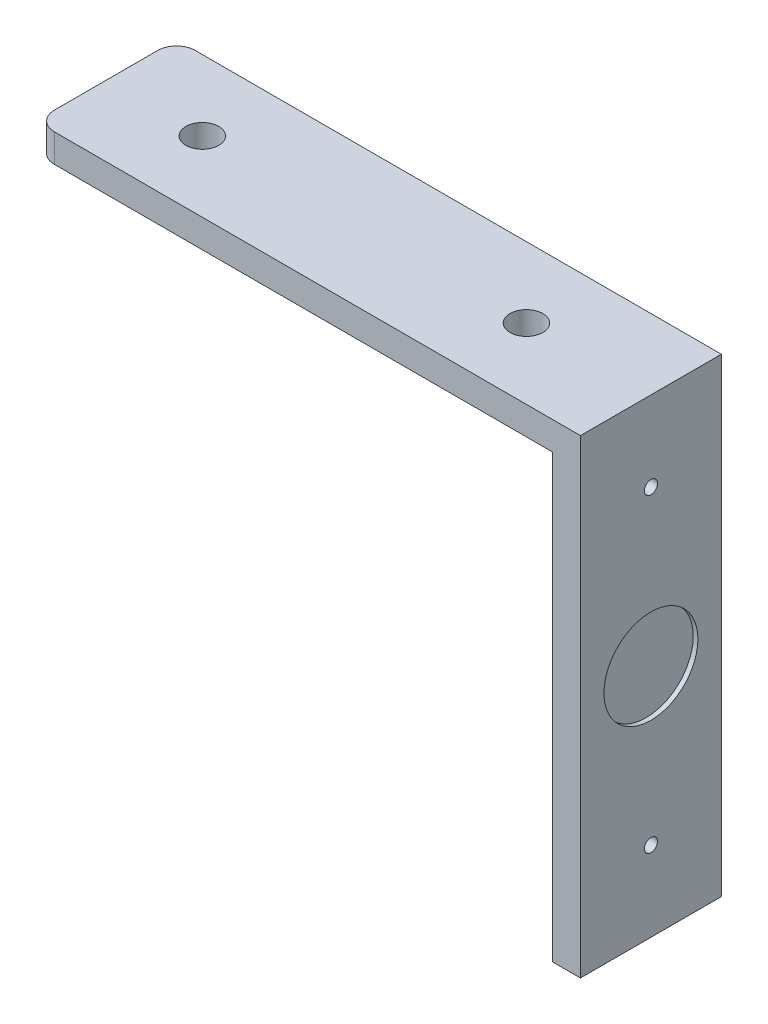
ISO-10303-21;
HEADER;
FILE_DESCRIPTION(('STEP AP214'),'2;1');
FILE_NAME('part.step','',(''),(''),'','','');
FILE_SCHEMA(('AUTOMOTIVE_DESIGN { 1 0 10303 214 1 1 1 1 }'));
ENDSEC;
DATA;
#1=APPLICATION_CONTEXT('core data for automotive mechanical design processes');
#2=APPLICATION_PROTOCOL_DEFINITION('international standard','automotive_design',2000,#1);
#3=PRODUCT_CONTEXT('',#1,'mechanical');
#4=PRODUCT('Part','Part','',(#3));
#5=PRODUCT_RELATED_PRODUCT_CATEGORY('part','',(#4));
#6=PRODUCT_DEFINITION_FORMATION('','',#4);
#7=PRODUCT_DEFINITION_CONTEXT('part definition',#1,'design');
#8=PRODUCT_DEFINITION('design','',#6,#7);
#9=PRODUCT_DEFINITION_SHAPE('','',#8);
#10=(LENGTH_UNIT() NAMED_UNIT(*) SI_UNIT(.MILLI.,.METRE.));
#11=(NAMED_UNIT(*) PLANE_ANGLE_UNIT() SI_UNIT($,.RADIAN.));
#12=(NAMED_UNIT(*) SI_UNIT($,.STERADIAN.) SOLID_ANGLE_UNIT());
#13=UNCERTAINTY_MEASURE_WITH_UNIT(LENGTH_MEASURE(1.E-05),#10,'distance_accuracy_value','');
#14=(GEOMETRIC_REPRESENTATION_CONTEXT(3) GLOBAL_UNCERTAINTY_ASSIGNED_CONTEXT((#13)) GLOBAL_UNIT_ASSIGNED_CONTEXT((#10,
#11,#12)) REPRESENTATION_CONTEXT('',''));
#15=CARTESIAN_POINT('',(0.,0.,0.));
#16=DIRECTION('',(0.,0.,1.));
#17=DIRECTION('',(1.,0.,0.));
#18=AXIS2_PLACEMENT_3D('',#15,#16,#17);
#19=CARTESIAN_POINT('',(-11.7258058761761,3.,18.6727949881747));
#20=DIRECTION('',(0.,1.,0.));
#21=DIRECTION('',(0.,0.,1.));
#22=AXIS2_PLACEMENT_3D('',#19,#20,#21);
#23=CYLINDRICAL_SURFACE('',#22,2.);
#24=DIRECTION('',(0.,1.,0.));
#25=VECTOR('',#24,1.);
#26=CARTESIAN_POINT('',(-13.7258058761761,3.,18.6727949881747));
#27=LINE('',#26,#25);
#28=CARTESIAN_POINT('',(-13.7258058761761,0.,18.6727949881747));
#29=VERTEX_POINT('',#28);
#30=CARTESIAN_POINT('',(-13.7258058761761,3.,18.6727949881747));
#31=VERTEX_POINT('',#30);
#32=EDGE_CURVE('E175',#29,#31,#27,.T.);
#33=ORIENTED_EDGE('',*,*,#32,.F.);
#34=CARTESIAN_POINT('',(-11.7258058761761,0.,18.6727949881747));
#35=DIRECTION('',(0.,1.,0.));
#36=DIRECTION('',(0.,0.,1.));
#37=AXIS2_PLACEMENT_3D('',#34,#35,#36);
#38=CIRCLE('',#37,2.);
#39=CARTESIAN_POINT('',(-11.7258058761761,0.,20.6727949881747));
#40=VERTEX_POINT('',#39);
#41=EDGE_CURVE('E40',#40,#29,#38,.F.);
#42=ORIENTED_EDGE('',*,*,#41,.F.);
#43=DIRECTION('',(0.,1.,0.));
#44=VECTOR('',#43,1.);
#45=CARTESIAN_POINT('',(-11.7258058761761,3.,20.6727949881747));
#46=LINE('',#45,#44);
#47=CARTESIAN_POINT('',(-11.7258058761761,3.,20.6727949881747));
#48=VERTEX_POINT('',#47);
#49=EDGE_CURVE('E178',#48,#40,#46,.F.);
#50=ORIENTED_EDGE('',*,*,#49,.F.);
#51=CARTESIAN_POINT('',(-11.7258058761761,3.,18.6727949881747));
#52=DIRECTION('',(0.,1.,0.));
#53=DIRECTION('',(0.,0.,1.));
#54=AXIS2_PLACEMENT_3D('',#51,#52,#53);
#55=CIRCLE('',#54,2.);
#56=EDGE_CURVE('E11',#31,#48,#55,.T.);
#57=ORIENTED_EDGE('',*,*,#56,.F.);
#58=EDGE_LOOP('',(#33,#42,#50,#57));
#59=FACE_BOUND('',#58,.T.);
#60=ADVANCED_FACE('F33',(#59),#23,.T.);
#61=CARTESIAN_POINT('',(-11.7258058761761,3.,7.6727949881747));
#62=DIRECTION('',(0.,-1.,0.));
#63=DIRECTION('',(0.,0.,-1.));
#64=AXIS2_PLACEMENT_3D('',#61,#62,#63);
#65=CYLINDRICAL_SURFACE('',#64,2.);
#66=DIRECTION('',(0.,-1.,0.));
#67=VECTOR('',#66,1.);
#68=CARTESIAN_POINT('',(-13.7258058761761,3.,7.6727949881747));
#69=LINE('',#68,#67);
#70=CARTESIAN_POINT('',(-13.7258058761761,3.,7.67279498817471));
#71=VERTEX_POINT('',#70);
#72=CARTESIAN_POINT('',(-13.7258058761761,0.,7.67279498817471));
#73=VERTEX_POINT('',#72);
#74=EDGE_CURVE('E158',#71,#73,#69,.T.);
#75=ORIENTED_EDGE('',*,*,#74,.F.);
#76=CARTESIAN_POINT('',(-11.7258058761761,3.,7.6727949881747));
#77=DIRECTION('',(0.,1.,0.));
#78=DIRECTION('',(0.,0.,1.));
#79=AXIS2_PLACEMENT_3D('',#76,#77,#78);
#80=CIRCLE('',#79,2.);
#81=CARTESIAN_POINT('',(-11.7258058761761,3.,5.6727949881747));
#82=VERTEX_POINT('',#81);
#83=EDGE_CURVE('E171',#82,#71,#80,.T.);
#84=ORIENTED_EDGE('',*,*,#83,.F.);
#85=DIRECTION('',(0.,-1.,0.));
#86=VECTOR('',#85,1.);
#87=CARTESIAN_POINT('',(-11.7258058761761,3.,5.6727949881747));
#88=LINE('',#87,#86);
#89=CARTESIAN_POINT('',(-11.7258058761761,0.,5.6727949881747));
#90=VERTEX_POINT('',#89);
#91=EDGE_CURVE('E168',#90,#82,#88,.F.);
#92=ORIENTED_EDGE('',*,*,#91,.F.);
#93=CARTESIAN_POINT('',(-11.7258058761761,0.,7.6727949881747));
#94=DIRECTION('',(0.,1.,0.));
#95=DIRECTION('',(0.,0.,1.));
#96=AXIS2_PLACEMENT_3D('',#93,#94,#95);
#97=CIRCLE('',#96,2.);
#98=EDGE_CURVE('E173',#73,#90,#97,.F.);
#99=ORIENTED_EDGE('',*,*,#98,.F.);
#100=EDGE_LOOP('',(#75,#84,#92,#99));
#101=FACE_BOUND('',#100,.T.);
#102=ADVANCED_FACE('F187',(#101),#65,.T.);
#103=CARTESIAN_POINT('',(-13.7258058761761,3.,5.6727949881747));
#104=DIRECTION('',(1.,0.,0.));
#105=DIRECTION('',(0.,0.,-1.));
#106=AXIS2_PLACEMENT_3D('',#103,#104,#105);
#107=PLANE('',#106);
#108=DIRECTION('',(0.,0.,1.));
#109=VECTOR('',#108,1.);
#110=CARTESIAN_POINT('',(-13.7258058761761,0.,5.6727949881747));
#111=LINE('',#110,#109);
#112=EDGE_CURVE('E147',#73,#29,#111,.T.);
#113=ORIENTED_EDGE('',*,*,#112,.T.);
#114=ORIENTED_EDGE('',*,*,#32,.T.);
#115=DIRECTION('',(0.,0.,1.));
#116=VECTOR('',#115,1.);
#117=CARTESIAN_POINT('',(-13.7258058761761,3.,5.6727949881747));
#118=LINE('',#117,#116);
#119=EDGE_CURVE('E150',#71,#31,#118,.T.);
#120=ORIENTED_EDGE('',*,*,#119,.F.);
#121=ORIENTED_EDGE('',*,*,#74,.T.);
#122=EDGE_LOOP('',(#113,#114,#120,#121));
#123=FACE_BOUND('',#122,.T.);
#124=ADVANCED_FACE('F184',(#123),#107,.F.);
#125=CARTESIAN_POINT('',(-13.7258058761761,3.,20.6727949881747));
#126=DIRECTION('',(0.,0.,-1.));
#127=DIRECTION('',(-1.,0.,0.));
#128=AXIS2_PLACEMENT_3D('',#125,#126,#127);
#129=PLANE('',#128);
#130=DIRECTION('',(1.,0.,0.));
#131=VECTOR('',#130,1.);
#132=CARTESIAN_POINT('',(-13.7258058761761,3.,20.6727949881747));
#133=LINE('',#132,#131);
#134=CARTESIAN_POINT('',(44.2741941238239,3.,20.6727949881747));
#135=VERTEX_POINT('',#134);
#136=EDGE_CURVE('E152',#48,#135,#133,.T.);
#137=ORIENTED_EDGE('',*,*,#136,.F.);
#138=ORIENTED_EDGE('',*,*,#49,.T.);
#139=DIRECTION('',(1.,0.,0.));
#140=VECTOR('',#139,1.);
#141=CARTESIAN_POINT('',(-13.7258058761761,0.,20.6727949881747));
#142=LINE('',#141,#140);
#143=CARTESIAN_POINT('',(41.2741941238239,0.,20.6727949881747));
#144=VERTEX_POINT('',#143);
#145=EDGE_CURVE('E101',#40,#144,#142,.T.);
#146=ORIENTED_EDGE('',*,*,#145,.T.);
#147=DIRECTION('',(0.,1.,0.));
#148=VECTOR('',#147,1.);
#149=CARTESIAN_POINT('',(41.2741941238239,-47.,20.6727949881747));
#150=LINE('',#149,#148);
#151=CARTESIAN_POINT('',(41.2741941238239,-47.,20.6727949881747));
#152=VERTEX_POINT('',#151);
#153=EDGE_CURVE('E94',#152,#144,#150,.T.);
#154=ORIENTED_EDGE('',*,*,#153,.F.);
#155=DIRECTION('',(1.,0.,0.));
#156=VECTOR('',#155,1.);
#157=CARTESIAN_POINT('',(41.2741941238239,-47.,20.6727949881747));
#158=LINE('',#157,#156);
#159=CARTESIAN_POINT('',(44.2741941238239,-47.,20.6727949881747));
#160=VERTEX_POINT('',#159);
#161=EDGE_CURVE('E99',#152,#160,#158,.T.);
#162=ORIENTED_EDGE('',*,*,#161,.T.);
#163=DIRECTION('',(0.,1.,0.));
#164=VECTOR('',#163,1.);
#165=CARTESIAN_POINT('',(44.2741941238239,-47.,20.6727949881747));
#166=LINE('',#165,#164);
#167=EDGE_CURVE('E106',#160,#135,#166,.T.);
#168=ORIENTED_EDGE('',*,*,#167,.T.);
#169=EDGE_LOOP('',(#137,#138,#146,#154,#162,#168));
#170=FACE_BOUND('',#169,.T.);
#171=ADVANCED_FACE('F97',(#170),#129,.F.);
#172=CARTESIAN_POINT('',(-13.7258058761761,3.,5.6727949881747));
#173=DIRECTION('',(0.,0.,1.));
#174=DIRECTION('',(1.,0.,0.));
#175=AXIS2_PLACEMENT_3D('',#172,#173,#174);
#176=PLANE('',#175);
#177=DIRECTION('',(-1.,0.,0.));
#178=VECTOR('',#177,1.);
#179=CARTESIAN_POINT('',(-13.7258058761761,0.,5.6727949881747));
#180=LINE('',#179,#178);
#181=CARTESIAN_POINT('',(41.2741941238239,0.,5.6727949881747));
#182=VERTEX_POINT('',#181);
#183=EDGE_CURVE('E153',#182,#90,#180,.T.);
#184=ORIENTED_EDGE('',*,*,#183,.T.);
#185=ORIENTED_EDGE('',*,*,#91,.T.);
#186=DIRECTION('',(-1.,0.,0.));
#187=VECTOR('',#186,1.);
#188=CARTESIAN_POINT('',(-13.7258058761761,3.,5.6727949881747));
#189=LINE('',#188,#187);
#190=CARTESIAN_POINT('',(44.2741941238239,3.,5.6727949881747));
#191=VERTEX_POINT('',#190);
#192=EDGE_CURVE('E155',#191,#82,#189,.T.);
#193=ORIENTED_EDGE('',*,*,#192,.F.);
#194=DIRECTION('',(0.,1.,0.));
#195=VECTOR('',#194,1.);
#196=CARTESIAN_POINT('',(44.2741941238239,-47.,5.6727949881747));
#197=LINE('',#196,#195);
#198=CARTESIAN_POINT('',(44.2741941238239,-47.,5.6727949881747));
#199=VERTEX_POINT('',#198);
#200=EDGE_CURVE('E134',#199,#191,#197,.T.);
#201=ORIENTED_EDGE('',*,*,#200,.F.);
#202=DIRECTION('',(-1.,0.,0.));
#203=VECTOR('',#202,1.);
#204=CARTESIAN_POINT('',(41.2741941238239,-47.,5.6727949881747));
#205=LINE('',#204,#203);
#206=CARTESIAN_POINT('',(41.2741941238239,-47.,5.6727949881747));
#207=VERTEX_POINT('',#206);
#208=EDGE_CURVE('E107',#199,#207,#205,.T.);
#209=ORIENTED_EDGE('',*,*,#208,.T.);
#210=DIRECTION('',(0.,1.,0.));
#211=VECTOR('',#210,1.);
#212=CARTESIAN_POINT('',(41.2741941238239,-47.,5.6727949881747));
#213=LINE('',#212,#211);
#214=EDGE_CURVE('E121',#207,#182,#213,.T.);
#215=ORIENTED_EDGE('',*,*,#214,.T.);
#216=EDGE_LOOP('',(#184,#185,#193,#201,#209,#215));
#217=FACE_BOUND('',#216,.T.);
#218=ADVANCED_FACE('F190',(#217),#176,.F.);
#219=CARTESIAN_POINT('',(0.,3.,0.));
#220=DIRECTION('',(0.,1.,0.));
#221=DIRECTION('',(0.,0.,1.));
#222=AXIS2_PLACEMENT_3D('',#219,#220,#221);
#223=PLANE('',#222);
#224=CARTESIAN_POINT('',(31.0241941238239,3.,13.1727949881747));
#225=DIRECTION('',(0.,-1.,0.));
#226=DIRECTION('',(0.,0.,1.));
#227=AXIS2_PLACEMENT_3D('',#224,#225,#226);
#228=CIRCLE('',#227,1.75);
#229=CARTESIAN_POINT('',(31.0241941238239,3.,14.9227949881747));
#230=VERTEX_POINT('',#229);
#231=EDGE_CURVE('E133',#230,#230,#228,.T.);
#232=ORIENTED_EDGE('',*,*,#231,.T.);
#233=EDGE_LOOP('',(#232));
#234=FACE_BOUND('',#233,.T.);
#235=CARTESIAN_POINT('',(-3.4758058761761,3.,13.1727949881747));
#236=DIRECTION('',(0.,1.,0.));
#237=DIRECTION('',(0.,0.,1.));
#238=AXIS2_PLACEMENT_3D('',#235,#236,#237);
#239=CIRCLE('',#238,1.75);
#240=CARTESIAN_POINT('',(-3.4758058761761,3.,14.9227949881747));
#241=VERTEX_POINT('',#240);
#242=EDGE_CURVE('E141',#241,#241,#239,.T.);
#243=ORIENTED_EDGE('',*,*,#242,.F.);
#244=EDGE_LOOP('',(#243));
#245=FACE_BOUND('',#244,.T.);
#246=ORIENTED_EDGE('',*,*,#119,.T.);
#247=ORIENTED_EDGE('',*,*,#56,.T.);
#248=ORIENTED_EDGE('',*,*,#136,.T.);
#249=DIRECTION('',(0.,0.,-1.));
#250=VECTOR('',#249,1.);
#251=CARTESIAN_POINT('',(44.2741941238239,3.,5.6727949881747));
#252=LINE('',#251,#250);
#253=EDGE_CURVE('E122',#135,#191,#252,.T.);
#254=ORIENTED_EDGE('',*,*,#253,.T.);
#255=ORIENTED_EDGE('',*,*,#192,.T.);
#256=ORIENTED_EDGE('',*,*,#83,.T.);
#257=EDGE_LOOP('',(#246,#247,#248,#254,#255,#256));
#258=FACE_BOUND('',#257,.T.);
#259=ADVANCED_FACE('F194',(#234,#245,#258),#223,.T.);
#260=CARTESIAN_POINT('',(0.,0.,0.));
#261=DIRECTION('',(0.,1.,0.));
#262=DIRECTION('',(0.,0.,1.));
#263=AXIS2_PLACEMENT_3D('',#260,#261,#262);
#264=PLANE('',#263);
#265=CARTESIAN_POINT('',(31.0241941238239,0.,13.1727949881747));
#266=DIRECTION('',(0.,-1.,0.));
#267=DIRECTION('',(0.,0.,1.));
#268=AXIS2_PLACEMENT_3D('',#265,#266,#267);
#269=CIRCLE('',#268,1.75);
#270=CARTESIAN_POINT('',(31.0241941238239,0.,14.9227949881747));
#271=VERTEX_POINT('',#270);
#272=EDGE_CURVE('E138',#271,#271,#269,.T.);
#273=ORIENTED_EDGE('',*,*,#272,.F.);
#274=EDGE_LOOP('',(#273));
#275=FACE_BOUND('',#274,.T.);
#276=CARTESIAN_POINT('',(-3.4758058761761,0.,13.1727949881747));
#277=DIRECTION('',(0.,1.,0.));
#278=DIRECTION('',(0.,0.,1.));
#279=AXIS2_PLACEMENT_3D('',#276,#277,#278);
#280=CIRCLE('',#279,1.75);
#281=CARTESIAN_POINT('',(-3.4758058761761,0.,14.9227949881747));
#282=VERTEX_POINT('',#281);
#283=EDGE_CURVE('E144',#282,#282,#280,.T.);
#284=ORIENTED_EDGE('',*,*,#283,.T.);
#285=EDGE_LOOP('',(#284));
#286=FACE_BOUND('',#285,.T.);
#287=ORIENTED_EDGE('',*,*,#145,.F.);
#288=ORIENTED_EDGE('',*,*,#41,.T.);
#289=ORIENTED_EDGE('',*,*,#112,.F.);
#290=ORIENTED_EDGE('',*,*,#98,.T.);
#291=ORIENTED_EDGE('',*,*,#183,.F.);
#292=DIRECTION('',(0.,0.,-1.));
#293=VECTOR('',#292,1.);
#294=CARTESIAN_POINT('',(41.2741941238239,0.,5.6727949881747));
#295=LINE('',#294,#293);
#296=EDGE_CURVE('E162',#144,#182,#295,.T.);
#297=ORIENTED_EDGE('',*,*,#296,.F.);
#298=EDGE_LOOP('',(#287,#288,#289,#290,#291,#297));
#299=FACE_BOUND('',#298,.T.);
#300=ADVANCED_FACE('F181',(#275,#286,#299),#264,.F.);
#301=CARTESIAN_POINT('',(-3.4758058761761,0.,13.1727949881747));
#302=DIRECTION('',(0.,1.,0.));
#303=DIRECTION('',(0.,0.,1.));
#304=AXIS2_PLACEMENT_3D('',#301,#302,#303);
#305=CYLINDRICAL_SURFACE('',#304,1.75);
#306=ORIENTED_EDGE('',*,*,#283,.F.);
#307=EDGE_LOOP('',(#306));
#308=FACE_BOUND('',#307,.T.);
#309=ORIENTED_EDGE('',*,*,#242,.T.);
#310=EDGE_LOOP('',(#309));
#311=FACE_BOUND('',#310,.T.);
#312=ADVANCED_FACE('F202',(#308,#311),#305,.F.);
#313=CARTESIAN_POINT('',(31.0241941238239,0.,13.1727949881747));
#314=DIRECTION('',(0.,1.,0.));
#315=DIRECTION('',(0.,0.,1.));
#316=AXIS2_PLACEMENT_3D('',#313,#314,#315);
#317=CYLINDRICAL_SURFACE('',#316,1.75);
#318=ORIENTED_EDGE('',*,*,#272,.T.);
#319=EDGE_LOOP('',(#318));
#320=FACE_BOUND('',#319,.T.);
#321=ORIENTED_EDGE('',*,*,#231,.F.);
#322=EDGE_LOOP('',(#321));
#323=FACE_BOUND('',#322,.T.);
#324=ADVANCED_FACE('F273',(#320,#323),#317,.F.);
#325=CARTESIAN_POINT('',(41.2741941238239,-47.,5.6727949881747));
#326=DIRECTION('',(-1.,0.,0.));
#327=DIRECTION('',(0.,0.,1.));
#328=AXIS2_PLACEMENT_3D('',#325,#326,#327);
#329=PLANE('',#328);
#330=CARTESIAN_POINT('',(41.2741941238239,-38.5,13.1727949881747));
#331=DIRECTION('',(-1.,0.,0.));
#332=DIRECTION('',(0.,0.,1.));
#333=AXIS2_PLACEMENT_3D('',#330,#331,#332);
#334=CIRCLE('',#333,0.7);
#335=CARTESIAN_POINT('',(41.2741941238239,-38.5,13.8727949881747));
#336=VERTEX_POINT('',#335);
#337=EDGE_CURVE('E361',#336,#336,#334,.F.);
#338=ORIENTED_EDGE('',*,*,#337,.T.);
#339=EDGE_LOOP('',(#338));
#340=FACE_BOUND('',#339,.T.);
#341=CARTESIAN_POINT('',(41.2741941238239,-5.5,13.1727949881747));
#342=DIRECTION('',(-1.,0.,0.));
#343=DIRECTION('',(0.,0.,1.));
#344=AXIS2_PLACEMENT_3D('',#341,#342,#343);
#345=CIRCLE('',#344,0.7);
#346=CARTESIAN_POINT('',(41.2741941238239,-5.5,13.8727949881747));
#347=VERTEX_POINT('',#346);
#348=EDGE_CURVE('E125',#347,#347,#345,.T.);
#349=ORIENTED_EDGE('',*,*,#348,.F.);
#350=EDGE_LOOP('',(#349));
#351=FACE_BOUND('',#350,.T.);
#352=ORIENTED_EDGE('',*,*,#153,.T.);
#353=ORIENTED_EDGE('',*,*,#296,.T.);
#354=ORIENTED_EDGE('',*,*,#214,.F.);
#355=DIRECTION('',(0.,0.,1.));
#356=VECTOR('',#355,1.);
#357=CARTESIAN_POINT('',(41.2741941238239,-47.,5.6727949881747));
#358=LINE('',#357,#356);
#359=EDGE_CURVE('E114',#207,#152,#358,.T.);
#360=ORIENTED_EDGE('',*,*,#359,.T.);
#361=EDGE_LOOP('',(#352,#353,#354,#360));
#362=FACE_BOUND('',#361,.T.);
#363=ADVANCED_FACE('F119',(#340,#351,#362),#329,.T.);
#364=CARTESIAN_POINT('',(44.2741941238239,-47.,5.6727949881747));
#365=DIRECTION('',(1.,0.,0.));
#366=DIRECTION('',(0.,0.,-1.));
#367=AXIS2_PLACEMENT_3D('',#364,#365,#366);
#368=PLANE('',#367);
#369=CARTESIAN_POINT('',(44.2741941238239,-22.,13.1727949881747));
#370=DIRECTION('',(1.,0.,0.));
#371=DIRECTION('',(0.,0.,-1.));
#372=AXIS2_PLACEMENT_3D('',#369,#370,#371);
#373=CIRCLE('',#372,5.);
#374=CARTESIAN_POINT('',(44.2741941238239,-22.,8.1727949881747));
#375=VERTEX_POINT('',#374);
#376=EDGE_CURVE('E358',#375,#375,#373,.T.);
#377=ORIENTED_EDGE('',*,*,#376,.F.);
#378=EDGE_LOOP('',(#377));
#379=FACE_BOUND('',#378,.T.);
#380=CARTESIAN_POINT('',(44.2741941238239,-38.5,13.1727949881747));
#381=DIRECTION('',(-1.,0.,0.));
#382=DIRECTION('',(0.,0.,-1.));
#383=AXIS2_PLACEMENT_3D('',#380,#381,#382);
#384=CIRCLE('',#383,0.7);
#385=CARTESIAN_POINT('',(44.2741941238239,-38.5,12.4727949881747));
#386=VERTEX_POINT('',#385);
#387=EDGE_CURVE('E357',#386,#386,#384,.T.);
#388=ORIENTED_EDGE('',*,*,#387,.T.);
#389=EDGE_LOOP('',(#388));
#390=FACE_BOUND('',#389,.T.);
#391=CARTESIAN_POINT('',(44.2741941238239,-5.5,13.1727949881747));
#392=DIRECTION('',(1.,0.,0.));
#393=DIRECTION('',(0.,0.,-1.));
#394=AXIS2_PLACEMENT_3D('',#391,#392,#393);
#395=CIRCLE('',#394,0.7);
#396=CARTESIAN_POINT('',(44.2741941238239,-5.5,12.4727949881747));
#397=VERTEX_POINT('',#396);
#398=EDGE_CURVE('E367',#397,#397,#395,.T.);
#399=ORIENTED_EDGE('',*,*,#398,.F.);
#400=EDGE_LOOP('',(#399));
#401=FACE_BOUND('',#400,.T.);
#402=ORIENTED_EDGE('',*,*,#253,.F.);
#403=ORIENTED_EDGE('',*,*,#167,.F.);
#404=DIRECTION('',(0.,0.,-1.));
#405=VECTOR('',#404,1.);
#406=CARTESIAN_POINT('',(44.2741941238239,-47.,5.6727949881747));
#407=LINE('',#406,#405);
#408=EDGE_CURVE('E117',#160,#199,#407,.T.);
#409=ORIENTED_EDGE('',*,*,#408,.T.);
#410=ORIENTED_EDGE('',*,*,#200,.T.);
#411=EDGE_LOOP('',(#402,#403,#409,#410));
#412=FACE_BOUND('',#411,.T.);
#413=ADVANCED_FACE('F193',(#379,#390,#401,#412),#368,.T.);
#414=CARTESIAN_POINT('',(0.,-47.,0.));
#415=DIRECTION('',(0.,1.,0.));
#416=DIRECTION('',(0.,0.,1.));
#417=AXIS2_PLACEMENT_3D('',#414,#415,#416);
#418=PLANE('',#417);
#419=ORIENTED_EDGE('',*,*,#359,.F.);
#420=ORIENTED_EDGE('',*,*,#208,.F.);
#421=ORIENTED_EDGE('',*,*,#408,.F.);
#422=ORIENTED_EDGE('',*,*,#161,.F.);
#423=EDGE_LOOP('',(#419,#420,#421,#422));
#424=FACE_BOUND('',#423,.T.);
#425=ADVANCED_FACE('F112',(#424),#418,.F.);
#426=CARTESIAN_POINT('',(-5.7258058761761,-5.5,13.1727949881747));
#427=DIRECTION('',(1.,0.,0.));
#428=DIRECTION('',(0.,0.,-1.));
#429=AXIS2_PLACEMENT_3D('',#426,#427,#428);
#430=CYLINDRICAL_SURFACE('',#429,0.7);
#431=ORIENTED_EDGE('',*,*,#348,.T.);
#432=EDGE_LOOP('',(#431));
#433=FACE_BOUND('',#432,.T.);
#434=ORIENTED_EDGE('',*,*,#398,.T.);
#435=EDGE_LOOP('',(#434));
#436=FACE_BOUND('',#435,.T.);
#437=ADVANCED_FACE('F251',(#433,#436),#430,.F.);
#438=CARTESIAN_POINT('',(-5.7258058761761,-38.5,13.1727949881747));
#439=DIRECTION('',(1.,0.,0.));
#440=DIRECTION('',(0.,0.,-1.));
#441=AXIS2_PLACEMENT_3D('',#438,#439,#440);
#442=CYLINDRICAL_SURFACE('',#441,0.7);
#443=ORIENTED_EDGE('',*,*,#337,.F.);
#444=EDGE_LOOP('',(#443));
#445=FACE_BOUND('',#444,.T.);
#446=ORIENTED_EDGE('',*,*,#387,.F.);
#447=EDGE_LOOP('',(#446));
#448=FACE_BOUND('',#447,.T.);
#449=ADVANCED_FACE('F262',(#445,#448),#442,.F.);
#450=CARTESIAN_POINT('',(43.7741941238239,-22.,13.1727949881747));
#451=DIRECTION('',(1.,0.,0.));
#452=DIRECTION('',(0.,0.,-1.));
#453=AXIS2_PLACEMENT_3D('',#450,#451,#452);
#454=CYLINDRICAL_SURFACE('',#453,5.);
#455=CARTESIAN_POINT('',(43.7741941238239,-22.,13.1727949881747));
#456=DIRECTION('',(1.,0.,0.));
#457=DIRECTION('',(0.,0.,-1.));
#458=AXIS2_PLACEMENT_3D('',#455,#456,#457);
#459=CIRCLE('',#458,5.);
#460=CARTESIAN_POINT('',(43.7741941238239,-22.,8.1727949881747));
#461=VERTEX_POINT('',#460);
#462=EDGE_CURVE('E356',#461,#461,#459,.T.);
#463=ORIENTED_EDGE('',*,*,#462,.F.);
#464=EDGE_LOOP('',(#463));
#465=FACE_BOUND('',#464,.T.);
#466=ORIENTED_EDGE('',*,*,#376,.T.);
#467=EDGE_LOOP('',(#466));
#468=FACE_BOUND('',#467,.T.);
#469=ADVANCED_FACE('F282',(#465,#468),#454,.F.);
#470=CARTESIAN_POINT('',(43.7741941238239,-22.,13.1727949881747));
#471=DIRECTION('',(1.,0.,0.));
#472=DIRECTION('',(0.,0.,-1.));
#473=AXIS2_PLACEMENT_3D('',#470,#471,#472);
#474=PLANE('',#473);
#475=ORIENTED_EDGE('',*,*,#462,.T.);
#476=EDGE_LOOP('',(#475));
#477=FACE_BOUND('',#476,.T.);
#478=ADVANCED_FACE('F299',(#477),#474,.T.);
#479=CLOSED_SHELL('',(#60,#102,#124,#171,#218,#259,#300,#312,#324,#363,#413,#425,#437,#449,#469,#478));
#480=MANIFOLD_SOLID_BREP('B2',#479);
#481=ADVANCED_BREP_SHAPE_REPRESENTATION('',(#18,#480),#14);
#482=SHAPE_DEFINITION_REPRESENTATION(#9,#481);
ENDSEC;
END-ISO-10303-21;
